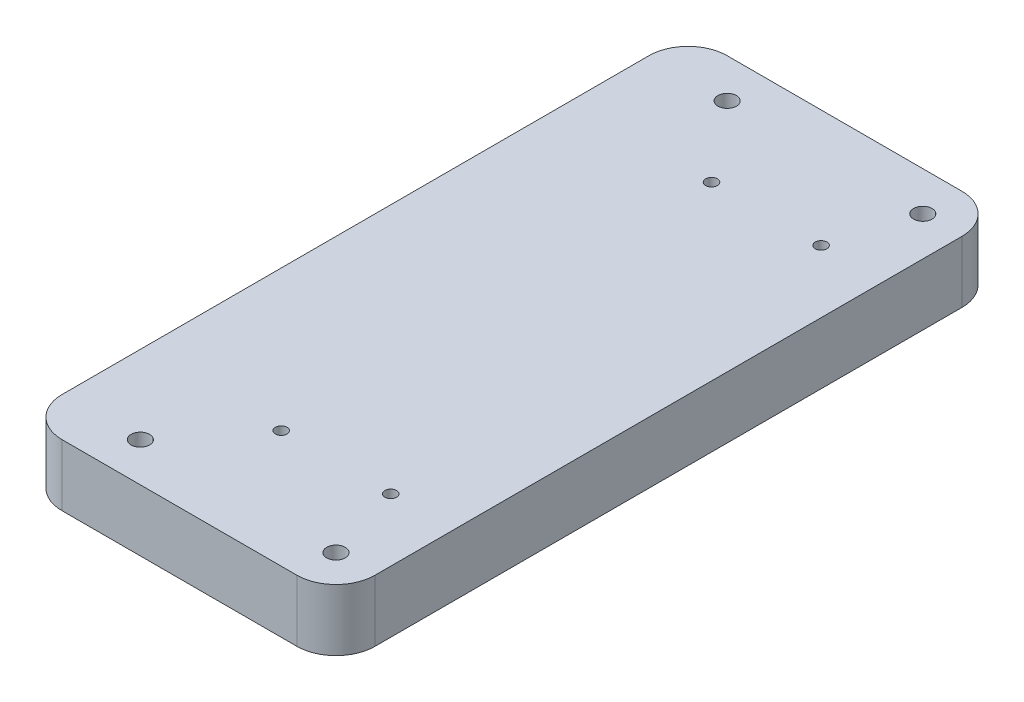
ISO-10303-21;
HEADER;
FILE_DESCRIPTION(('STEP AP214'),'2;1');
FILE_NAME('part.step','',(''),(''),'','','');
FILE_SCHEMA(('AUTOMOTIVE_DESIGN { 1 0 10303 214 1 1 1 1 }'));
ENDSEC;
DATA;
#1=APPLICATION_CONTEXT('core data for automotive mechanical design processes');
#2=APPLICATION_PROTOCOL_DEFINITION('international standard','automotive_design',2000,#1);
#3=PRODUCT_CONTEXT('',#1,'mechanical');
#4=PRODUCT('Part','Part','',(#3));
#5=PRODUCT_RELATED_PRODUCT_CATEGORY('part','',(#4));
#6=PRODUCT_DEFINITION_FORMATION('','',#4);
#7=PRODUCT_DEFINITION_CONTEXT('part definition',#1,'design');
#8=PRODUCT_DEFINITION('design','',#6,#7);
#9=PRODUCT_DEFINITION_SHAPE('','',#8);
#10=(LENGTH_UNIT() NAMED_UNIT(*) SI_UNIT(.MILLI.,.METRE.));
#11=(NAMED_UNIT(*) PLANE_ANGLE_UNIT() SI_UNIT($,.RADIAN.));
#12=(NAMED_UNIT(*) SI_UNIT($,.STERADIAN.) SOLID_ANGLE_UNIT());
#13=UNCERTAINTY_MEASURE_WITH_UNIT(LENGTH_MEASURE(1.E-05),#10,'distance_accuracy_value','');
#14=(GEOMETRIC_REPRESENTATION_CONTEXT(3) GLOBAL_UNCERTAINTY_ASSIGNED_CONTEXT((#13)) GLOBAL_UNIT_ASSIGNED_CONTEXT((#10,
#11,#12)) REPRESENTATION_CONTEXT('',''));
#15=CARTESIAN_POINT('',(0.,0.,0.));
#16=DIRECTION('',(0.,0.,1.));
#17=DIRECTION('',(1.,0.,0.));
#18=AXIS2_PLACEMENT_3D('',#15,#16,#17);
#19=CARTESIAN_POINT('',(0.,20.,0.));
#20=DIRECTION('',(1.,0.,0.));
#21=DIRECTION('',(0.,0.,-1.));
#22=AXIS2_PLACEMENT_3D('',#19,#20,#21);
#23=PLANE('',#22);
#24=DIRECTION('',(0.,0.,1.));
#25=VECTOR('',#24,1.);
#26=CARTESIAN_POINT('',(0.,20.,0.));
#27=LINE('',#26,#25);
#28=CARTESIAN_POINT('',(0.,20.,-203.2));
#29=VERTEX_POINT('',#28);
#30=CARTESIAN_POINT('',(0.,20.,-12.7));
#31=VERTEX_POINT('',#30);
#32=EDGE_CURVE('E127',#29,#31,#27,.T.);
#33=ORIENTED_EDGE('',*,*,#32,.F.);
#34=DIRECTION('',(0.,-1.,0.));
#35=VECTOR('',#34,1.);
#36=CARTESIAN_POINT('',(0.,20.,-203.2));
#37=LINE('',#36,#35);
#38=CARTESIAN_POINT('',(0.,0.,-203.2));
#39=VERTEX_POINT('',#38);
#40=EDGE_CURVE('E111',#29,#39,#37,.T.);
#41=ORIENTED_EDGE('',*,*,#40,.T.);
#42=DIRECTION('',(0.,0.,1.));
#43=VECTOR('',#42,1.);
#44=CARTESIAN_POINT('',(0.,0.,0.));
#45=LINE('',#44,#43);
#46=CARTESIAN_POINT('',(0.,0.,-12.7));
#47=VERTEX_POINT('',#46);
#48=EDGE_CURVE('E124',#39,#47,#45,.T.);
#49=ORIENTED_EDGE('',*,*,#48,.T.);
#50=DIRECTION('',(0.,-1.,0.));
#51=VECTOR('',#50,1.);
#52=CARTESIAN_POINT('',(0.,20.,-12.7));
#53=LINE('',#52,#51);
#54=EDGE_CURVE('E130',#47,#31,#53,.F.);
#55=ORIENTED_EDGE('',*,*,#54,.T.);
#56=EDGE_LOOP('',(#33,#41,#49,#55));
#57=FACE_BOUND('',#56,.T.);
#58=ADVANCED_FACE('F40',(#57),#23,.F.);
#59=CARTESIAN_POINT('',(0.,20.,0.));
#60=DIRECTION('',(0.,0.,-1.));
#61=DIRECTION('',(-1.,0.,0.));
#62=AXIS2_PLACEMENT_3D('',#59,#60,#61);
#63=PLANE('',#62);
#64=DIRECTION('',(1.,0.,0.));
#65=VECTOR('',#64,1.);
#66=CARTESIAN_POINT('',(0.,0.,0.));
#67=LINE('',#66,#65);
#68=CARTESIAN_POINT('',(12.7,0.,0.));
#69=VERTEX_POINT('',#68);
#70=CARTESIAN_POINT('',(88.9,0.,0.));
#71=VERTEX_POINT('',#70);
#72=EDGE_CURVE('E136',#69,#71,#67,.T.);
#73=ORIENTED_EDGE('',*,*,#72,.T.);
#74=DIRECTION('',(0.,-1.,0.));
#75=VECTOR('',#74,1.);
#76=CARTESIAN_POINT('',(88.9,20.,0.));
#77=LINE('',#76,#75);
#78=CARTESIAN_POINT('',(88.9,20.,0.));
#79=VERTEX_POINT('',#78);
#80=EDGE_CURVE('E11',#71,#79,#77,.F.);
#81=ORIENTED_EDGE('',*,*,#80,.T.);
#82=DIRECTION('',(1.,0.,0.));
#83=VECTOR('',#82,1.);
#84=CARTESIAN_POINT('',(0.,20.,0.));
#85=LINE('',#84,#83);
#86=CARTESIAN_POINT('',(12.7,20.,0.));
#87=VERTEX_POINT('',#86);
#88=EDGE_CURVE('E192',#87,#79,#85,.T.);
#89=ORIENTED_EDGE('',*,*,#88,.F.);
#90=DIRECTION('',(0.,-1.,0.));
#91=VECTOR('',#90,1.);
#92=CARTESIAN_POINT('',(12.7,20.,0.));
#93=LINE('',#92,#91);
#94=EDGE_CURVE('E49',#87,#69,#93,.T.);
#95=ORIENTED_EDGE('',*,*,#94,.T.);
#96=EDGE_LOOP('',(#73,#81,#89,#95));
#97=FACE_BOUND('',#96,.T.);
#98=ADVANCED_FACE('F190',(#97),#63,.F.);
#99=CARTESIAN_POINT('',(101.6,20.,0.));
#100=DIRECTION('',(-1.,0.,0.));
#101=DIRECTION('',(0.,0.,1.));
#102=AXIS2_PLACEMENT_3D('',#99,#100,#101);
#103=PLANE('',#102);
#104=DIRECTION('',(0.,0.,-1.));
#105=VECTOR('',#104,1.);
#106=CARTESIAN_POINT('',(101.6,20.,0.));
#107=LINE('',#106,#105);
#108=CARTESIAN_POINT('',(101.6,20.,-12.7));
#109=VERTEX_POINT('',#108);
#110=CARTESIAN_POINT('',(101.6,20.,-203.2));
#111=VERTEX_POINT('',#110);
#112=EDGE_CURVE('E200',#109,#111,#107,.T.);
#113=ORIENTED_EDGE('',*,*,#112,.F.);
#114=DIRECTION('',(0.,-1.,0.));
#115=VECTOR('',#114,1.);
#116=CARTESIAN_POINT('',(101.6,20.,-12.7));
#117=LINE('',#116,#115);
#118=CARTESIAN_POINT('',(101.6,0.,-12.7));
#119=VERTEX_POINT('',#118);
#120=EDGE_CURVE('E182',#109,#119,#117,.T.);
#121=ORIENTED_EDGE('',*,*,#120,.T.);
#122=DIRECTION('',(0.,0.,-1.));
#123=VECTOR('',#122,1.);
#124=CARTESIAN_POINT('',(101.6,0.,0.));
#125=LINE('',#124,#123);
#126=CARTESIAN_POINT('',(101.6,0.,-203.2));
#127=VERTEX_POINT('',#126);
#128=EDGE_CURVE('E142',#119,#127,#125,.T.);
#129=ORIENTED_EDGE('',*,*,#128,.T.);
#130=DIRECTION('',(0.,-1.,0.));
#131=VECTOR('',#130,1.);
#132=CARTESIAN_POINT('',(101.6,20.,-203.2));
#133=LINE('',#132,#131);
#134=EDGE_CURVE('E56',#127,#111,#133,.F.);
#135=ORIENTED_EDGE('',*,*,#134,.T.);
#136=EDGE_LOOP('',(#113,#121,#129,#135));
#137=FACE_BOUND('',#136,.T.);
#138=ADVANCED_FACE('F199',(#137),#103,.F.);
#139=CARTESIAN_POINT('',(0.,20.,-215.9));
#140=DIRECTION('',(0.,0.,1.));
#141=DIRECTION('',(1.,0.,0.));
#142=AXIS2_PLACEMENT_3D('',#139,#140,#141);
#143=PLANE('',#142);
#144=DIRECTION('',(-1.,0.,0.));
#145=VECTOR('',#144,1.);
#146=CARTESIAN_POINT('',(0.,0.,-215.9));
#147=LINE('',#146,#145);
#148=CARTESIAN_POINT('',(88.9,0.,-215.9));
#149=VERTEX_POINT('',#148);
#150=CARTESIAN_POINT('',(12.7,0.,-215.9));
#151=VERTEX_POINT('',#150);
#152=EDGE_CURVE('E153',#149,#151,#147,.T.);
#153=ORIENTED_EDGE('',*,*,#152,.T.);
#154=DIRECTION('',(0.,-1.,0.));
#155=VECTOR('',#154,1.);
#156=CARTESIAN_POINT('',(12.7,20.,-215.9));
#157=LINE('',#156,#155);
#158=CARTESIAN_POINT('',(12.7,20.,-215.9));
#159=VERTEX_POINT('',#158);
#160=EDGE_CURVE('E112',#151,#159,#157,.F.);
#161=ORIENTED_EDGE('',*,*,#160,.T.);
#162=DIRECTION('',(-1.,0.,0.));
#163=VECTOR('',#162,1.);
#164=CARTESIAN_POINT('',(0.,20.,-215.9));
#165=LINE('',#164,#163);
#166=CARTESIAN_POINT('',(88.9,20.,-215.9));
#167=VERTEX_POINT('',#166);
#168=EDGE_CURVE('E148',#167,#159,#165,.T.);
#169=ORIENTED_EDGE('',*,*,#168,.F.);
#170=DIRECTION('',(0.,-1.,0.));
#171=VECTOR('',#170,1.);
#172=CARTESIAN_POINT('',(88.9,20.,-215.9));
#173=LINE('',#172,#171);
#174=EDGE_CURVE('E118',#167,#149,#173,.T.);
#175=ORIENTED_EDGE('',*,*,#174,.T.);
#176=EDGE_LOOP('',(#153,#161,#169,#175));
#177=FACE_BOUND('',#176,.T.);
#178=ADVANCED_FACE('F283',(#177),#143,.F.);
#179=CARTESIAN_POINT('',(0.,20.,0.));
#180=DIRECTION('',(0.,-1.,0.));
#181=DIRECTION('',(0.,0.,-1.));
#182=AXIS2_PLACEMENT_3D('',#179,#180,#181);
#183=PLANE('',#182);
#184=CARTESIAN_POINT('',(81.28,20.,-38.1000000000002));
#185=DIRECTION('',(0.,1.,0.));
#186=DIRECTION('',(0.,0.,1.));
#187=AXIS2_PLACEMENT_3D('',#184,#185,#186);
#188=CIRCLE('',#187,1.90499999999999);
#189=CARTESIAN_POINT('',(81.28,20.,-36.1950000000003));
#190=VERTEX_POINT('',#189);
#191=EDGE_CURVE('E246',#190,#190,#188,.T.);
#192=ORIENTED_EDGE('',*,*,#191,.F.);
#193=EDGE_LOOP('',(#192));
#194=FACE_BOUND('',#193,.T.);
#195=CARTESIAN_POINT('',(45.7200000000001,20.,-38.1000000000003));
#196=DIRECTION('',(0.,1.,0.));
#197=DIRECTION('',(0.,0.,1.));
#198=AXIS2_PLACEMENT_3D('',#195,#196,#197);
#199=CIRCLE('',#198,1.90500000000004);
#200=CARTESIAN_POINT('',(45.7200000000001,20.,-36.1950000000003));
#201=VERTEX_POINT('',#200);
#202=EDGE_CURVE('E254',#201,#201,#199,.T.);
#203=ORIENTED_EDGE('',*,*,#202,.F.);
#204=EDGE_LOOP('',(#203));
#205=FACE_BOUND('',#204,.T.);
#206=CARTESIAN_POINT('',(45.7200000000001,20.,-177.8));
#207=DIRECTION('',(0.,1.,0.));
#208=DIRECTION('',(0.,0.,1.));
#209=AXIS2_PLACEMENT_3D('',#206,#207,#208);
#210=CIRCLE('',#209,1.90499999999999);
#211=CARTESIAN_POINT('',(45.7200000000001,20.,-175.895));
#212=VERTEX_POINT('',#211);
#213=EDGE_CURVE('E262',#212,#212,#210,.T.);
#214=ORIENTED_EDGE('',*,*,#213,.F.);
#215=EDGE_LOOP('',(#214));
#216=FACE_BOUND('',#215,.T.);
#217=CARTESIAN_POINT('',(81.2800000000001,20.,-177.8));
#218=DIRECTION('',(0.,1.,0.));
#219=DIRECTION('',(0.,0.,1.));
#220=AXIS2_PLACEMENT_3D('',#217,#218,#219);
#221=CIRCLE('',#220,1.90499999999999);
#222=CARTESIAN_POINT('',(81.2800000000001,20.,-175.895));
#223=VERTEX_POINT('',#222);
#224=EDGE_CURVE('E238',#223,#223,#221,.T.);
#225=ORIENTED_EDGE('',*,*,#224,.F.);
#226=EDGE_LOOP('',(#225));
#227=FACE_BOUND('',#226,.T.);
#228=CARTESIAN_POINT('',(25.4,20.,-203.2));
#229=DIRECTION('',(0.,-1.,0.));
#230=DIRECTION('',(0.,0.,-1.));
#231=AXIS2_PLACEMENT_3D('',#228,#229,#230);
#232=CIRCLE('',#231,3.);
#233=CARTESIAN_POINT('',(25.4,20.,-206.2));
#234=VERTEX_POINT('',#233);
#235=EDGE_CURVE('E212',#234,#234,#232,.T.);
#236=ORIENTED_EDGE('',*,*,#235,.T.);
#237=EDGE_LOOP('',(#236));
#238=FACE_BOUND('',#237,.T.);
#239=CARTESIAN_POINT('',(88.9,20.,-12.7));
#240=DIRECTION('',(0.,-1.,0.));
#241=DIRECTION('',(0.,0.,-1.));
#242=AXIS2_PLACEMENT_3D('',#239,#240,#241);
#243=CIRCLE('',#242,3.00000000000001);
#244=CARTESIAN_POINT('',(88.9,20.,-15.7));
#245=VERTEX_POINT('',#244);
#246=EDGE_CURVE('E218',#245,#245,#243,.T.);
#247=ORIENTED_EDGE('',*,*,#246,.T.);
#248=EDGE_LOOP('',(#247));
#249=FACE_BOUND('',#248,.T.);
#250=CARTESIAN_POINT('',(25.4,20.,-12.7));
#251=DIRECTION('',(0.,-1.,0.));
#252=DIRECTION('',(0.,0.,-1.));
#253=AXIS2_PLACEMENT_3D('',#250,#251,#252);
#254=CIRCLE('',#253,2.99999999999999);
#255=CARTESIAN_POINT('',(25.4,20.,-15.7));
#256=VERTEX_POINT('',#255);
#257=EDGE_CURVE('E219',#256,#256,#254,.T.);
#258=ORIENTED_EDGE('',*,*,#257,.T.);
#259=EDGE_LOOP('',(#258));
#260=FACE_BOUND('',#259,.T.);
#261=CARTESIAN_POINT('',(88.9,20.,-203.2));
#262=DIRECTION('',(0.,-1.,0.));
#263=DIRECTION('',(0.,0.,-1.));
#264=AXIS2_PLACEMENT_3D('',#261,#262,#263);
#265=CIRCLE('',#264,3.00000000000001);
#266=CARTESIAN_POINT('',(88.9,20.,-206.2));
#267=VERTEX_POINT('',#266);
#268=EDGE_CURVE('E137',#267,#267,#265,.T.);
#269=ORIENTED_EDGE('',*,*,#268,.T.);
#270=EDGE_LOOP('',(#269));
#271=FACE_BOUND('',#270,.T.);
#272=ORIENTED_EDGE('',*,*,#168,.T.);
#273=CARTESIAN_POINT('',(12.7,20.,-203.2));
#274=DIRECTION('',(0.,-1.,0.));
#275=DIRECTION('',(0.,0.,-1.));
#276=AXIS2_PLACEMENT_3D('',#273,#274,#275);
#277=CIRCLE('',#276,12.7);
#278=EDGE_CURVE('E177',#159,#29,#277,.F.);
#279=ORIENTED_EDGE('',*,*,#278,.T.);
#280=ORIENTED_EDGE('',*,*,#32,.T.);
#281=CARTESIAN_POINT('',(12.7,20.,-12.7));
#282=DIRECTION('',(0.,-1.,0.));
#283=DIRECTION('',(0.,0.,-1.));
#284=AXIS2_PLACEMENT_3D('',#281,#282,#283);
#285=CIRCLE('',#284,12.7);
#286=EDGE_CURVE('E172',#31,#87,#285,.F.);
#287=ORIENTED_EDGE('',*,*,#286,.T.);
#288=ORIENTED_EDGE('',*,*,#88,.T.);
#289=CARTESIAN_POINT('',(88.9,20.,-12.7));
#290=DIRECTION('',(0.,-1.,0.));
#291=DIRECTION('',(0.,0.,-1.));
#292=AXIS2_PLACEMENT_3D('',#289,#290,#291);
#293=CIRCLE('',#292,12.7);
#294=EDGE_CURVE('E63',#79,#109,#293,.F.);
#295=ORIENTED_EDGE('',*,*,#294,.T.);
#296=ORIENTED_EDGE('',*,*,#112,.T.);
#297=CARTESIAN_POINT('',(88.9,20.,-203.2));
#298=DIRECTION('',(0.,-1.,0.));
#299=DIRECTION('',(0.,0.,-1.));
#300=AXIS2_PLACEMENT_3D('',#297,#298,#299);
#301=CIRCLE('',#300,12.7);
#302=EDGE_CURVE('E169',#111,#167,#301,.F.);
#303=ORIENTED_EDGE('',*,*,#302,.T.);
#304=EDGE_LOOP('',(#272,#279,#280,#287,#288,#295,#296,#303));
#305=FACE_BOUND('',#304,.T.);
#306=ADVANCED_FACE('F280',(#194,#205,#216,#227,#238,#249,#260,#271,#305),#183,.F.);
#307=CARTESIAN_POINT('',(0.,0.,0.));
#308=DIRECTION('',(0.,-1.,0.));
#309=DIRECTION('',(0.,0.,-1.));
#310=AXIS2_PLACEMENT_3D('',#307,#308,#309);
#311=PLANE('',#310);
#312=CARTESIAN_POINT('',(81.28,0.,-38.1000000000002));
#313=DIRECTION('',(0.,1.,0.));
#314=DIRECTION('',(0.,0.,1.));
#315=AXIS2_PLACEMENT_3D('',#312,#313,#314);
#316=CIRCLE('',#315,1.90499999999999);
#317=CARTESIAN_POINT('',(81.28,0.,-36.1950000000003));
#318=VERTEX_POINT('',#317);
#319=EDGE_CURVE('E250',#318,#318,#316,.T.);
#320=ORIENTED_EDGE('',*,*,#319,.T.);
#321=EDGE_LOOP('',(#320));
#322=FACE_BOUND('',#321,.T.);
#323=CARTESIAN_POINT('',(45.7200000000001,0.,-38.1000000000003));
#324=DIRECTION('',(0.,1.,0.));
#325=DIRECTION('',(0.,0.,1.));
#326=AXIS2_PLACEMENT_3D('',#323,#324,#325);
#327=CIRCLE('',#326,1.90500000000004);
#328=CARTESIAN_POINT('',(45.7200000000001,0.,-36.1950000000003));
#329=VERTEX_POINT('',#328);
#330=EDGE_CURVE('E258',#329,#329,#327,.T.);
#331=ORIENTED_EDGE('',*,*,#330,.T.);
#332=EDGE_LOOP('',(#331));
#333=FACE_BOUND('',#332,.T.);
#334=CARTESIAN_POINT('',(45.7200000000001,0.,-177.8));
#335=DIRECTION('',(0.,1.,0.));
#336=DIRECTION('',(0.,0.,1.));
#337=AXIS2_PLACEMENT_3D('',#334,#335,#336);
#338=CIRCLE('',#337,1.90499999999999);
#339=CARTESIAN_POINT('',(45.7200000000001,0.,-175.895));
#340=VERTEX_POINT('',#339);
#341=EDGE_CURVE('E242',#340,#340,#338,.T.);
#342=ORIENTED_EDGE('',*,*,#341,.T.);
#343=EDGE_LOOP('',(#342));
#344=FACE_BOUND('',#343,.T.);
#345=CARTESIAN_POINT('',(81.2800000000001,0.,-177.8));
#346=DIRECTION('',(0.,1.,0.));
#347=DIRECTION('',(0.,0.,1.));
#348=AXIS2_PLACEMENT_3D('',#345,#346,#347);
#349=CIRCLE('',#348,1.90499999999999);
#350=CARTESIAN_POINT('',(81.2800000000001,0.,-175.895));
#351=VERTEX_POINT('',#350);
#352=EDGE_CURVE('E234',#351,#351,#349,.T.);
#353=ORIENTED_EDGE('',*,*,#352,.T.);
#354=EDGE_LOOP('',(#353));
#355=FACE_BOUND('',#354,.T.);
#356=CARTESIAN_POINT('',(25.4,0.,-203.2));
#357=DIRECTION('',(0.,-1.,0.));
#358=DIRECTION('',(0.,0.,-1.));
#359=AXIS2_PLACEMENT_3D('',#356,#357,#358);
#360=CIRCLE('',#359,3.);
#361=CARTESIAN_POINT('',(25.4,0.,-206.2));
#362=VERTEX_POINT('',#361);
#363=EDGE_CURVE('E223',#362,#362,#360,.T.);
#364=ORIENTED_EDGE('',*,*,#363,.F.);
#365=EDGE_LOOP('',(#364));
#366=FACE_BOUND('',#365,.T.);
#367=CARTESIAN_POINT('',(88.9,0.,-12.7));
#368=DIRECTION('',(0.,-1.,0.));
#369=DIRECTION('',(0.,0.,-1.));
#370=AXIS2_PLACEMENT_3D('',#367,#368,#369);
#371=CIRCLE('',#370,3.00000000000001);
#372=CARTESIAN_POINT('',(88.9,0.,-15.7));
#373=VERTEX_POINT('',#372);
#374=EDGE_CURVE('E214',#373,#373,#371,.T.);
#375=ORIENTED_EDGE('',*,*,#374,.F.);
#376=EDGE_LOOP('',(#375));
#377=FACE_BOUND('',#376,.T.);
#378=CARTESIAN_POINT('',(25.4,0.,-12.7));
#379=DIRECTION('',(0.,-1.,0.));
#380=DIRECTION('',(0.,0.,-1.));
#381=AXIS2_PLACEMENT_3D('',#378,#379,#380);
#382=CIRCLE('',#381,2.99999999999999);
#383=CARTESIAN_POINT('',(25.4,0.,-15.7));
#384=VERTEX_POINT('',#383);
#385=EDGE_CURVE('E230',#384,#384,#382,.T.);
#386=ORIENTED_EDGE('',*,*,#385,.F.);
#387=EDGE_LOOP('',(#386));
#388=FACE_BOUND('',#387,.T.);
#389=CARTESIAN_POINT('',(88.9,0.,-203.2));
#390=DIRECTION('',(0.,-1.,0.));
#391=DIRECTION('',(0.,0.,-1.));
#392=AXIS2_PLACEMENT_3D('',#389,#390,#391);
#393=CIRCLE('',#392,3.00000000000001);
#394=CARTESIAN_POINT('',(88.9,0.,-206.2));
#395=VERTEX_POINT('',#394);
#396=EDGE_CURVE('E145',#395,#395,#393,.T.);
#397=ORIENTED_EDGE('',*,*,#396,.F.);
#398=EDGE_LOOP('',(#397));
#399=FACE_BOUND('',#398,.T.);
#400=ORIENTED_EDGE('',*,*,#48,.F.);
#401=CARTESIAN_POINT('',(12.7,0.,-203.2));
#402=DIRECTION('',(0.,-1.,0.));
#403=DIRECTION('',(0.,0.,-1.));
#404=AXIS2_PLACEMENT_3D('',#401,#402,#403);
#405=CIRCLE('',#404,12.7);
#406=EDGE_CURVE('E107',#39,#151,#405,.T.);
#407=ORIENTED_EDGE('',*,*,#406,.T.);
#408=ORIENTED_EDGE('',*,*,#152,.F.);
#409=CARTESIAN_POINT('',(88.9,0.,-203.2));
#410=DIRECTION('',(0.,-1.,0.));
#411=DIRECTION('',(0.,0.,-1.));
#412=AXIS2_PLACEMENT_3D('',#409,#410,#411);
#413=CIRCLE('',#412,12.7);
#414=EDGE_CURVE('E129',#149,#127,#413,.T.);
#415=ORIENTED_EDGE('',*,*,#414,.T.);
#416=ORIENTED_EDGE('',*,*,#128,.F.);
#417=CARTESIAN_POINT('',(88.9,0.,-12.7));
#418=DIRECTION('',(0.,-1.,0.));
#419=DIRECTION('',(0.,0.,-1.));
#420=AXIS2_PLACEMENT_3D('',#417,#418,#419);
#421=CIRCLE('',#420,12.7);
#422=EDGE_CURVE('E119',#119,#71,#421,.T.);
#423=ORIENTED_EDGE('',*,*,#422,.T.);
#424=ORIENTED_EDGE('',*,*,#72,.F.);
#425=CARTESIAN_POINT('',(12.7,0.,-12.7));
#426=DIRECTION('',(0.,-1.,0.));
#427=DIRECTION('',(0.,0.,-1.));
#428=AXIS2_PLACEMENT_3D('',#425,#426,#427);
#429=CIRCLE('',#428,12.7);
#430=EDGE_CURVE('E134',#69,#47,#429,.T.);
#431=ORIENTED_EDGE('',*,*,#430,.T.);
#432=EDGE_LOOP('',(#400,#407,#408,#415,#416,#423,#424,#431));
#433=FACE_BOUND('',#432,.T.);
#434=ADVANCED_FACE('F132',(#322,#333,#344,#355,#366,#377,#388,#399,#433),#311,.T.);
#435=CARTESIAN_POINT('',(12.7,20.,-203.2));
#436=DIRECTION('',(0.,-1.,0.));
#437=DIRECTION('',(0.,0.,-1.));
#438=AXIS2_PLACEMENT_3D('',#435,#436,#437);
#439=CYLINDRICAL_SURFACE('',#438,12.7);
#440=ORIENTED_EDGE('',*,*,#278,.F.);
#441=ORIENTED_EDGE('',*,*,#160,.F.);
#442=ORIENTED_EDGE('',*,*,#406,.F.);
#443=ORIENTED_EDGE('',*,*,#40,.F.);
#444=EDGE_LOOP('',(#440,#441,#442,#443));
#445=FACE_BOUND('',#444,.T.);
#446=ADVANCED_FACE('F110',(#445),#439,.T.);
#447=CARTESIAN_POINT('',(88.9,20.,-12.7));
#448=DIRECTION('',(0.,-1.,0.));
#449=DIRECTION('',(0.,0.,-1.));
#450=AXIS2_PLACEMENT_3D('',#447,#448,#449);
#451=CYLINDRICAL_SURFACE('',#450,12.7);
#452=ORIENTED_EDGE('',*,*,#294,.F.);
#453=ORIENTED_EDGE('',*,*,#80,.F.);
#454=ORIENTED_EDGE('',*,*,#422,.F.);
#455=ORIENTED_EDGE('',*,*,#120,.F.);
#456=EDGE_LOOP('',(#452,#453,#454,#455));
#457=FACE_BOUND('',#456,.T.);
#458=ADVANCED_FACE('F198',(#457),#451,.T.);
#459=CARTESIAN_POINT('',(12.7,20.,-12.7));
#460=DIRECTION('',(0.,-1.,0.));
#461=DIRECTION('',(0.,0.,-1.));
#462=AXIS2_PLACEMENT_3D('',#459,#460,#461);
#463=CYLINDRICAL_SURFACE('',#462,12.7);
#464=ORIENTED_EDGE('',*,*,#286,.F.);
#465=ORIENTED_EDGE('',*,*,#54,.F.);
#466=ORIENTED_EDGE('',*,*,#430,.F.);
#467=ORIENTED_EDGE('',*,*,#94,.F.);
#468=EDGE_LOOP('',(#464,#465,#466,#467));
#469=FACE_BOUND('',#468,.T.);
#470=ADVANCED_FACE('F301',(#469),#463,.T.);
#471=CARTESIAN_POINT('',(88.9,20.,-203.2));
#472=DIRECTION('',(0.,-1.,0.));
#473=DIRECTION('',(0.,0.,-1.));
#474=AXIS2_PLACEMENT_3D('',#471,#472,#473);
#475=CYLINDRICAL_SURFACE('',#474,12.7);
#476=ORIENTED_EDGE('',*,*,#302,.F.);
#477=ORIENTED_EDGE('',*,*,#134,.F.);
#478=ORIENTED_EDGE('',*,*,#414,.F.);
#479=ORIENTED_EDGE('',*,*,#174,.F.);
#480=EDGE_LOOP('',(#476,#477,#478,#479));
#481=FACE_BOUND('',#480,.T.);
#482=ADVANCED_FACE('F42',(#481),#475,.T.);
#483=CARTESIAN_POINT('',(88.9,20.,-203.2));
#484=DIRECTION('',(0.,-1.,0.));
#485=DIRECTION('',(0.,0.,-1.));
#486=AXIS2_PLACEMENT_3D('',#483,#484,#485);
#487=CYLINDRICAL_SURFACE('',#486,3.00000000000001);
#488=ORIENTED_EDGE('',*,*,#268,.F.);
#489=EDGE_LOOP('',(#488));
#490=FACE_BOUND('',#489,.T.);
#491=ORIENTED_EDGE('',*,*,#396,.T.);
#492=EDGE_LOOP('',(#491));
#493=FACE_BOUND('',#492,.T.);
#494=ADVANCED_FACE('F300',(#490,#493),#487,.F.);
#495=CARTESIAN_POINT('',(25.4,20.,-12.7));
#496=DIRECTION('',(0.,-1.,0.));
#497=DIRECTION('',(0.,0.,-1.));
#498=AXIS2_PLACEMENT_3D('',#495,#496,#497);
#499=CYLINDRICAL_SURFACE('',#498,2.99999999999999);
#500=ORIENTED_EDGE('',*,*,#257,.F.);
#501=EDGE_LOOP('',(#500));
#502=FACE_BOUND('',#501,.T.);
#503=ORIENTED_EDGE('',*,*,#385,.T.);
#504=EDGE_LOOP('',(#503));
#505=FACE_BOUND('',#504,.T.);
#506=ADVANCED_FACE('F306',(#502,#505),#499,.F.);
#507=CARTESIAN_POINT('',(88.9,20.,-12.7));
#508=DIRECTION('',(0.,-1.,0.));
#509=DIRECTION('',(0.,0.,-1.));
#510=AXIS2_PLACEMENT_3D('',#507,#508,#509);
#511=CYLINDRICAL_SURFACE('',#510,3.00000000000001);
#512=ORIENTED_EDGE('',*,*,#246,.F.);
#513=EDGE_LOOP('',(#512));
#514=FACE_BOUND('',#513,.T.);
#515=ORIENTED_EDGE('',*,*,#374,.T.);
#516=EDGE_LOOP('',(#515));
#517=FACE_BOUND('',#516,.T.);
#518=ADVANCED_FACE('F348',(#514,#517),#511,.F.);
#519=CARTESIAN_POINT('',(25.4,20.,-203.2));
#520=DIRECTION('',(0.,-1.,0.));
#521=DIRECTION('',(0.,0.,-1.));
#522=AXIS2_PLACEMENT_3D('',#519,#520,#521);
#523=CYLINDRICAL_SURFACE('',#522,3.);
#524=ORIENTED_EDGE('',*,*,#235,.F.);
#525=EDGE_LOOP('',(#524));
#526=FACE_BOUND('',#525,.T.);
#527=ORIENTED_EDGE('',*,*,#363,.T.);
#528=EDGE_LOOP('',(#527));
#529=FACE_BOUND('',#528,.T.);
#530=ADVANCED_FACE('F358',(#526,#529),#523,.F.);
#531=CARTESIAN_POINT('',(81.2800000000001,0.,-177.8));
#532=DIRECTION('',(0.,1.,0.));
#533=DIRECTION('',(0.,0.,1.));
#534=AXIS2_PLACEMENT_3D('',#531,#532,#533);
#535=CYLINDRICAL_SURFACE('',#534,1.90499999999999);
#536=ORIENTED_EDGE('',*,*,#352,.F.);
#537=EDGE_LOOP('',(#536));
#538=FACE_BOUND('',#537,.T.);
#539=ORIENTED_EDGE('',*,*,#224,.T.);
#540=EDGE_LOOP('',(#539));
#541=FACE_BOUND('',#540,.T.);
#542=ADVANCED_FACE('F276',(#538,#541),#535,.F.);
#543=CARTESIAN_POINT('',(45.7200000000001,0.,-177.8));
#544=DIRECTION('',(0.,1.,0.));
#545=DIRECTION('',(0.,0.,1.));
#546=AXIS2_PLACEMENT_3D('',#543,#544,#545);
#547=CYLINDRICAL_SURFACE('',#546,1.90499999999999);
#548=ORIENTED_EDGE('',*,*,#341,.F.);
#549=EDGE_LOOP('',(#548));
#550=FACE_BOUND('',#549,.T.);
#551=ORIENTED_EDGE('',*,*,#213,.T.);
#552=EDGE_LOOP('',(#551));
#553=FACE_BOUND('',#552,.T.);
#554=ADVANCED_FACE('F272',(#550,#553),#547,.F.);
#555=CARTESIAN_POINT('',(45.7200000000001,0.,-38.1000000000003));
#556=DIRECTION('',(0.,1.,0.));
#557=DIRECTION('',(0.,0.,1.));
#558=AXIS2_PLACEMENT_3D('',#555,#556,#557);
#559=CYLINDRICAL_SURFACE('',#558,1.90500000000004);
#560=ORIENTED_EDGE('',*,*,#330,.F.);
#561=EDGE_LOOP('',(#560));
#562=FACE_BOUND('',#561,.T.);
#563=ORIENTED_EDGE('',*,*,#202,.T.);
#564=EDGE_LOOP('',(#563));
#565=FACE_BOUND('',#564,.T.);
#566=ADVANCED_FACE('F275',(#562,#565),#559,.F.);
#567=CARTESIAN_POINT('',(81.28,0.,-38.1000000000002));
#568=DIRECTION('',(0.,1.,0.));
#569=DIRECTION('',(0.,0.,1.));
#570=AXIS2_PLACEMENT_3D('',#567,#568,#569);
#571=CYLINDRICAL_SURFACE('',#570,1.90499999999999);
#572=ORIENTED_EDGE('',*,*,#319,.F.);
#573=EDGE_LOOP('',(#572));
#574=FACE_BOUND('',#573,.T.);
#575=ORIENTED_EDGE('',*,*,#191,.T.);
#576=EDGE_LOOP('',(#575));
#577=FACE_BOUND('',#576,.T.);
#578=ADVANCED_FACE('F405',(#574,#577),#571,.F.);
#579=CLOSED_SHELL('',(#58,#98,#138,#178,#306,#434,#446,#458,#470,#482,#494,#506,#518,#530,#542,
#554,#566,#578));
#580=MANIFOLD_SOLID_BREP('B2',#579);
#581=ADVANCED_BREP_SHAPE_REPRESENTATION('',(#18,#580),#14);
#582=SHAPE_DEFINITION_REPRESENTATION(#9,#581);
ENDSEC;
END-ISO-10303-21;
